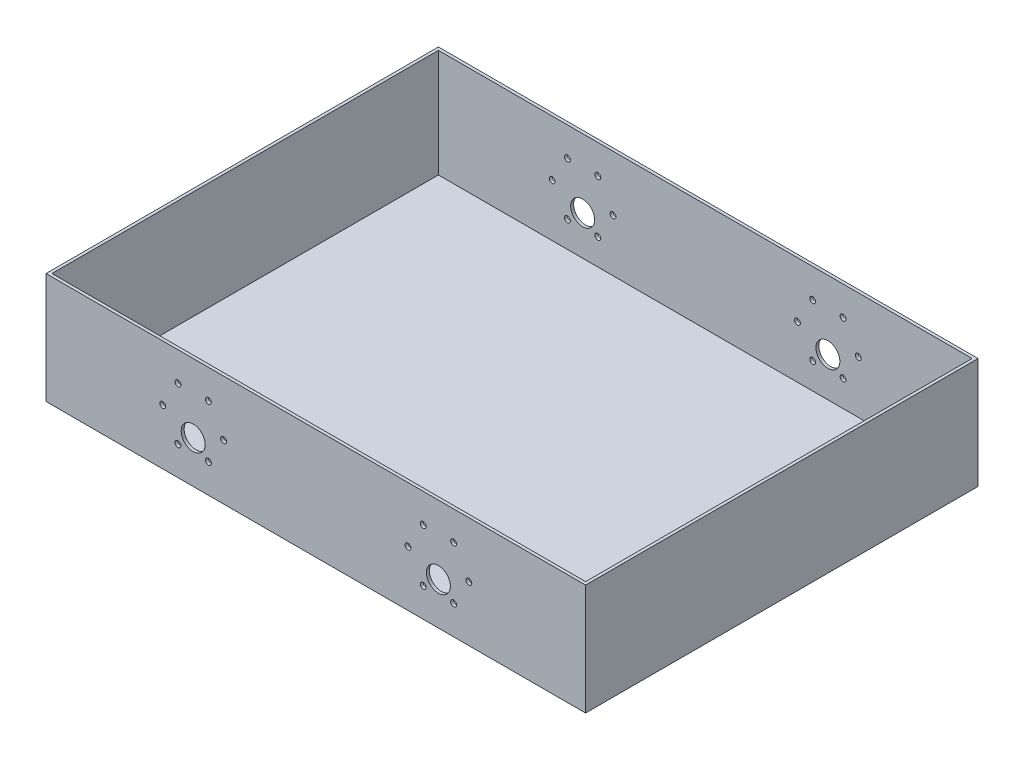
ISO-10303-21;
HEADER;
FILE_DESCRIPTION(('STEP AP214'),'2;1');
FILE_NAME('part.step','',(''),(''),'','','');
FILE_SCHEMA(('AUTOMOTIVE_DESIGN { 1 0 10303 214 1 1 1 1 }'));
ENDSEC;
DATA;
#1=APPLICATION_CONTEXT('core data for automotive mechanical design processes');
#2=APPLICATION_PROTOCOL_DEFINITION('international standard','automotive_design',2000,#1);
#3=PRODUCT_CONTEXT('',#1,'mechanical');
#4=PRODUCT('Part','Part','',(#3));
#5=PRODUCT_RELATED_PRODUCT_CATEGORY('part','',(#4));
#6=PRODUCT_DEFINITION_FORMATION('','',#4);
#7=PRODUCT_DEFINITION_CONTEXT('part definition',#1,'design');
#8=PRODUCT_DEFINITION('design','',#6,#7);
#9=PRODUCT_DEFINITION_SHAPE('','',#8);
#10=(LENGTH_UNIT() NAMED_UNIT(*) SI_UNIT(.MILLI.,.METRE.));
#11=(NAMED_UNIT(*) PLANE_ANGLE_UNIT() SI_UNIT($,.RADIAN.));
#12=(NAMED_UNIT(*) SI_UNIT($,.STERADIAN.) SOLID_ANGLE_UNIT());
#13=UNCERTAINTY_MEASURE_WITH_UNIT(LENGTH_MEASURE(1.E-05),#10,'distance_accuracy_value','');
#14=(GEOMETRIC_REPRESENTATION_CONTEXT(3) GLOBAL_UNCERTAINTY_ASSIGNED_CONTEXT((#13)) GLOBAL_UNIT_ASSIGNED_CONTEXT((#10,
#11,#12)) REPRESENTATION_CONTEXT('',''));
#15=CARTESIAN_POINT('',(0.,0.,0.));
#16=DIRECTION('',(0.,0.,1.));
#17=DIRECTION('',(1.,0.,0.));
#18=AXIS2_PLACEMENT_3D('',#15,#16,#17);
#19=CARTESIAN_POINT('',(-137.5,1.5,-100.));
#20=DIRECTION('',(0.,0.,1.));
#21=DIRECTION('',(1.,0.,0.));
#22=AXIS2_PLACEMENT_3D('',#19,#20,#21);
#23=PLANE('',#22);
#24=CARTESIAN_POINT('',(70.2499999999999,41.6733937586589,-100.));
#25=DIRECTION('',(0.,0.,-1.));
#26=DIRECTION('',(-1.,0.,0.));
#27=AXIS2_PLACEMENT_3D('',#24,#25,#26);
#28=CIRCLE('',#27,1.50000000000001);
#29=CARTESIAN_POINT('',(68.7499999999999,41.6733937586589,-100.));
#30=VERTEX_POINT('',#29);
#31=EDGE_CURVE('E376',#30,#30,#28,.T.);
#32=ORIENTED_EDGE('',*,*,#31,.F.);
#33=EDGE_LOOP('',(#32));
#34=FACE_BOUND('',#33,.T.);
#35=CARTESIAN_POINT('',(78.,28.2500000000001,-100.));
#36=DIRECTION('',(0.,0.,-1.));
#37=DIRECTION('',(-1.,0.,0.));
#38=AXIS2_PLACEMENT_3D('',#35,#36,#37);
#39=CIRCLE('',#38,1.50000000000001);
#40=CARTESIAN_POINT('',(76.5,28.2500000000001,-100.));
#41=VERTEX_POINT('',#40);
#42=EDGE_CURVE('E372',#41,#41,#39,.T.);
#43=ORIENTED_EDGE('',*,*,#42,.F.);
#44=EDGE_LOOP('',(#43));
#45=FACE_BOUND('',#44,.T.);
#46=CARTESIAN_POINT('',(54.7500000000001,14.8266062413412,-100.));
#47=DIRECTION('',(0.,0.,-1.));
#48=DIRECTION('',(-1.,0.,0.));
#49=AXIS2_PLACEMENT_3D('',#46,#47,#48);
#50=CIRCLE('',#49,1.5);
#51=CARTESIAN_POINT('',(53.2500000000001,14.8266062413412,-100.));
#52=VERTEX_POINT('',#51);
#53=EDGE_CURVE('E370',#52,#52,#50,.T.);
#54=ORIENTED_EDGE('',*,*,#53,.F.);
#55=EDGE_LOOP('',(#54));
#56=FACE_BOUND('',#55,.T.);
#57=CARTESIAN_POINT('',(70.2500000000001,14.8266062413412,-100.));
#58=DIRECTION('',(0.,0.,-1.));
#59=DIRECTION('',(-1.,0.,0.));
#60=AXIS2_PLACEMENT_3D('',#57,#58,#59);
#61=CIRCLE('',#60,1.5);
#62=CARTESIAN_POINT('',(68.7500000000001,14.8266062413412,-100.));
#63=VERTEX_POINT('',#62);
#64=EDGE_CURVE('E373',#63,#63,#61,.T.);
#65=ORIENTED_EDGE('',*,*,#64,.F.);
#66=EDGE_LOOP('',(#65));
#67=FACE_BOUND('',#66,.T.);
#68=CARTESIAN_POINT('',(-70.2500000000001,41.6733937586587,-100.));
#69=DIRECTION('',(0.,0.,-1.));
#70=DIRECTION('',(-1.,0.,0.));
#71=AXIS2_PLACEMENT_3D('',#68,#69,#70);
#72=CIRCLE('',#71,1.5);
#73=CARTESIAN_POINT('',(-71.7500000000001,41.6733937586587,-100.));
#74=VERTEX_POINT('',#73);
#75=EDGE_CURVE('E379',#74,#74,#72,.T.);
#76=ORIENTED_EDGE('',*,*,#75,.F.);
#77=EDGE_LOOP('',(#76));
#78=FACE_BOUND('',#77,.T.);
#79=CARTESIAN_POINT('',(-54.7500000000001,41.6733937586589,-100.));
#80=DIRECTION('',(0.,0.,-1.));
#81=DIRECTION('',(-1.,0.,0.));
#82=AXIS2_PLACEMENT_3D('',#79,#80,#81);
#83=CIRCLE('',#82,1.49999999999999);
#84=CARTESIAN_POINT('',(-56.2500000000001,41.6733937586589,-100.));
#85=VERTEX_POINT('',#84);
#86=EDGE_CURVE('E385',#85,#85,#83,.T.);
#87=ORIENTED_EDGE('',*,*,#86,.F.);
#88=EDGE_LOOP('',(#87));
#89=FACE_BOUND('',#88,.T.);
#90=CARTESIAN_POINT('',(-47.,28.2500000000001,-100.));
#91=DIRECTION('',(0.,0.,-1.));
#92=DIRECTION('',(-1.,0.,0.));
#93=AXIS2_PLACEMENT_3D('',#90,#91,#92);
#94=CIRCLE('',#93,1.49999999999999);
#95=CARTESIAN_POINT('',(-48.5,28.2500000000001,-100.));
#96=VERTEX_POINT('',#95);
#97=EDGE_CURVE('E388',#96,#96,#94,.T.);
#98=ORIENTED_EDGE('',*,*,#97,.F.);
#99=EDGE_LOOP('',(#98));
#100=FACE_BOUND('',#99,.T.);
#101=CARTESIAN_POINT('',(-54.7499999999999,14.8266062413412,-100.));
#102=DIRECTION('',(0.,0.,-1.));
#103=DIRECTION('',(-1.,0.,0.));
#104=AXIS2_PLACEMENT_3D('',#101,#102,#103);
#105=CIRCLE('',#104,1.50000000000001);
#106=CARTESIAN_POINT('',(-56.2499999999999,14.8266062413412,-100.));
#107=VERTEX_POINT('',#106);
#108=EDGE_CURVE('E391',#107,#107,#105,.T.);
#109=ORIENTED_EDGE('',*,*,#108,.F.);
#110=EDGE_LOOP('',(#109));
#111=FACE_BOUND('',#110,.T.);
#112=CARTESIAN_POINT('',(62.5,21.5,-100.));
#113=DIRECTION('',(0.,0.,-1.));
#114=DIRECTION('',(-1.,0.,0.));
#115=AXIS2_PLACEMENT_3D('',#112,#113,#114);
#116=CIRCLE('',#115,6.1);
#117=CARTESIAN_POINT('',(56.4,21.5,-100.));
#118=VERTEX_POINT('',#117);
#119=EDGE_CURVE('E491',#118,#118,#116,.T.);
#120=ORIENTED_EDGE('',*,*,#119,.F.);
#121=EDGE_LOOP('',(#120));
#122=FACE_BOUND('',#121,.T.);
#123=CARTESIAN_POINT('',(47.,28.25,-100.));
#124=DIRECTION('',(0.,0.,-1.));
#125=DIRECTION('',(-1.,0.,0.));
#126=AXIS2_PLACEMENT_3D('',#123,#124,#125);
#127=CIRCLE('',#126,1.5);
#128=CARTESIAN_POINT('',(45.5,28.25,-100.));
#129=VERTEX_POINT('',#128);
#130=EDGE_CURVE('E494',#129,#129,#127,.T.);
#131=ORIENTED_EDGE('',*,*,#130,.F.);
#132=EDGE_LOOP('',(#131));
#133=FACE_BOUND('',#132,.T.);
#134=CARTESIAN_POINT('',(-78.,28.25,-100.));
#135=DIRECTION('',(0.,0.,-1.));
#136=DIRECTION('',(-1.,0.,0.));
#137=AXIS2_PLACEMENT_3D('',#134,#135,#136);
#138=CIRCLE('',#137,1.5);
#139=CARTESIAN_POINT('',(-79.5,28.25,-100.));
#140=VERTEX_POINT('',#139);
#141=EDGE_CURVE('E499',#140,#140,#138,.T.);
#142=ORIENTED_EDGE('',*,*,#141,.F.);
#143=EDGE_LOOP('',(#142));
#144=FACE_BOUND('',#143,.T.);
#145=CARTESIAN_POINT('',(-70.2499999999999,14.8266062413412,-100.));
#146=DIRECTION('',(0.,0.,-1.));
#147=DIRECTION('',(-1.,0.,0.));
#148=AXIS2_PLACEMENT_3D('',#145,#146,#147);
#149=CIRCLE('',#148,1.5);
#150=CARTESIAN_POINT('',(-71.7499999999999,14.8266062413412,-100.));
#151=VERTEX_POINT('',#150);
#152=EDGE_CURVE('E394',#151,#151,#149,.T.);
#153=ORIENTED_EDGE('',*,*,#152,.F.);
#154=EDGE_LOOP('',(#153));
#155=FACE_BOUND('',#154,.T.);
#156=CARTESIAN_POINT('',(54.7499999999999,41.6733937586587,-100.));
#157=DIRECTION('',(0.,0.,-1.));
#158=DIRECTION('',(-1.,0.,0.));
#159=AXIS2_PLACEMENT_3D('',#156,#157,#158);
#160=CIRCLE('',#159,1.5);
#161=CARTESIAN_POINT('',(53.2499999999999,41.6733937586587,-100.));
#162=VERTEX_POINT('',#161);
#163=EDGE_CURVE('E182',#162,#162,#160,.T.);
#164=ORIENTED_EDGE('',*,*,#163,.F.);
#165=EDGE_LOOP('',(#164));
#166=FACE_BOUND('',#165,.T.);
#167=DIRECTION('',(-1.,0.,0.));
#168=VECTOR('',#167,1.);
#169=CARTESIAN_POINT('',(-137.5,0.,-100.));
#170=LINE('',#169,#168);
#171=CARTESIAN_POINT('',(137.5,0.,-100.));
#172=VERTEX_POINT('',#171);
#173=CARTESIAN_POINT('',(-137.5,0.,-100.));
#174=VERTEX_POINT('',#173);
#175=EDGE_CURVE('E167',#172,#174,#170,.T.);
#176=ORIENTED_EDGE('',*,*,#175,.T.);
#177=DIRECTION('',(0.,-1.,0.));
#178=VECTOR('',#177,1.);
#179=CARTESIAN_POINT('',(-137.5,1.5,-100.));
#180=LINE('',#179,#178);
#181=CARTESIAN_POINT('',(-137.5,56.5,-100.));
#182=VERTEX_POINT('',#181);
#183=EDGE_CURVE('E50',#182,#174,#180,.T.);
#184=ORIENTED_EDGE('',*,*,#183,.F.);
#185=DIRECTION('',(-1.,0.,0.));
#186=VECTOR('',#185,1.);
#187=CARTESIAN_POINT('',(137.5,56.5,-100.));
#188=LINE('',#187,#186);
#189=CARTESIAN_POINT('',(137.5,56.5,-100.));
#190=VERTEX_POINT('',#189);
#191=EDGE_CURVE('E155',#190,#182,#188,.T.);
#192=ORIENTED_EDGE('',*,*,#191,.F.);
#193=DIRECTION('',(0.,-1.,0.));
#194=VECTOR('',#193,1.);
#195=CARTESIAN_POINT('',(137.5,1.5,-100.));
#196=LINE('',#195,#194);
#197=EDGE_CURVE('E11',#190,#172,#196,.T.);
#198=ORIENTED_EDGE('',*,*,#197,.T.);
#199=EDGE_LOOP('',(#176,#184,#192,#198));
#200=FACE_BOUND('',#199,.T.);
#201=CARTESIAN_POINT('',(-62.5,21.5,-100.));
#202=DIRECTION('',(0.,0.,1.));
#203=DIRECTION('',(1.,0.,0.));
#204=AXIS2_PLACEMENT_3D('',#201,#202,#203);
#205=CIRCLE('',#204,6.1);
#206=CARTESIAN_POINT('',(-56.4,21.5,-100.));
#207=VERTEX_POINT('',#206);
#208=EDGE_CURVE('E489',#207,#207,#205,.T.);
#209=ORIENTED_EDGE('',*,*,#208,.T.);
#210=EDGE_LOOP('',(#209));
#211=FACE_BOUND('',#210,.T.);
#212=ADVANCED_FACE('F41',(#34,#45,#56,#67,#78,#89,#100,#111,#122,#133,#144,#155,#166,#200,#211),
#23,.F.);
#213=CARTESIAN_POINT('',(-137.5,1.5,100.));
#214=DIRECTION('',(0.,0.,-1.));
#215=DIRECTION('',(-1.,0.,0.));
#216=AXIS2_PLACEMENT_3D('',#213,#214,#215);
#217=PLANE('',#216);
#218=CARTESIAN_POINT('',(70.2499999999999,41.6733937586589,100.));
#219=DIRECTION('',(0.,0.,-1.));
#220=DIRECTION('',(-1.,0.,0.));
#221=AXIS2_PLACEMENT_3D('',#218,#219,#220);
#222=CIRCLE('',#221,1.50000000000001);
#223=CARTESIAN_POINT('',(68.7499999999999,41.6733937586589,100.));
#224=VERTEX_POINT('',#223);
#225=EDGE_CURVE('E142',#224,#224,#222,.T.);
#226=ORIENTED_EDGE('',*,*,#225,.T.);
#227=EDGE_LOOP('',(#226));
#228=FACE_BOUND('',#227,.T.);
#229=CARTESIAN_POINT('',(78.,28.2500000000001,100.));
#230=DIRECTION('',(0.,0.,-1.));
#231=DIRECTION('',(-1.,0.,0.));
#232=AXIS2_PLACEMENT_3D('',#229,#230,#231);
#233=CIRCLE('',#232,1.50000000000001);
#234=CARTESIAN_POINT('',(76.5,28.2500000000001,100.));
#235=VERTEX_POINT('',#234);
#236=EDGE_CURVE('E244',#235,#235,#233,.T.);
#237=ORIENTED_EDGE('',*,*,#236,.T.);
#238=EDGE_LOOP('',(#237));
#239=FACE_BOUND('',#238,.T.);
#240=CARTESIAN_POINT('',(54.7500000000001,14.8266062413412,100.));
#241=DIRECTION('',(0.,0.,-1.));
#242=DIRECTION('',(-1.,0.,0.));
#243=AXIS2_PLACEMENT_3D('',#240,#241,#242);
#244=CIRCLE('',#243,1.5);
#245=CARTESIAN_POINT('',(53.2500000000001,14.8266062413412,100.));
#246=VERTEX_POINT('',#245);
#247=EDGE_CURVE('E240',#246,#246,#244,.T.);
#248=ORIENTED_EDGE('',*,*,#247,.T.);
#249=EDGE_LOOP('',(#248));
#250=FACE_BOUND('',#249,.T.);
#251=CARTESIAN_POINT('',(70.2500000000001,14.8266062413412,100.));
#252=DIRECTION('',(0.,0.,-1.));
#253=DIRECTION('',(-1.,0.,0.));
#254=AXIS2_PLACEMENT_3D('',#251,#252,#253);
#255=CIRCLE('',#254,1.5);
#256=CARTESIAN_POINT('',(68.7500000000001,14.8266062413412,100.));
#257=VERTEX_POINT('',#256);
#258=EDGE_CURVE('E236',#257,#257,#255,.T.);
#259=ORIENTED_EDGE('',*,*,#258,.T.);
#260=EDGE_LOOP('',(#259));
#261=FACE_BOUND('',#260,.T.);
#262=CARTESIAN_POINT('',(-70.2500000000001,41.6733937586587,100.));
#263=DIRECTION('',(0.,0.,-1.));
#264=DIRECTION('',(-1.,0.,0.));
#265=AXIS2_PLACEMENT_3D('',#262,#263,#264);
#266=CIRCLE('',#265,1.5);
#267=CARTESIAN_POINT('',(-71.7500000000001,41.6733937586587,100.));
#268=VERTEX_POINT('',#267);
#269=EDGE_CURVE('E232',#268,#268,#266,.T.);
#270=ORIENTED_EDGE('',*,*,#269,.T.);
#271=EDGE_LOOP('',(#270));
#272=FACE_BOUND('',#271,.T.);
#273=CARTESIAN_POINT('',(-54.7500000000001,41.6733937586589,100.));
#274=DIRECTION('',(0.,0.,-1.));
#275=DIRECTION('',(-1.,0.,0.));
#276=AXIS2_PLACEMENT_3D('',#273,#274,#275);
#277=CIRCLE('',#276,1.49999999999999);
#278=CARTESIAN_POINT('',(-56.2500000000001,41.6733937586589,100.));
#279=VERTEX_POINT('',#278);
#280=EDGE_CURVE('E227',#279,#279,#277,.T.);
#281=ORIENTED_EDGE('',*,*,#280,.T.);
#282=EDGE_LOOP('',(#281));
#283=FACE_BOUND('',#282,.T.);
#284=CARTESIAN_POINT('',(-47.,28.2500000000001,100.));
#285=DIRECTION('',(0.,0.,-1.));
#286=DIRECTION('',(-1.,0.,0.));
#287=AXIS2_PLACEMENT_3D('',#284,#285,#286);
#288=CIRCLE('',#287,1.49999999999999);
#289=CARTESIAN_POINT('',(-48.5,28.2500000000001,100.));
#290=VERTEX_POINT('',#289);
#291=EDGE_CURVE('E222',#290,#290,#288,.T.);
#292=ORIENTED_EDGE('',*,*,#291,.T.);
#293=EDGE_LOOP('',(#292));
#294=FACE_BOUND('',#293,.T.);
#295=CARTESIAN_POINT('',(-54.7499999999999,14.8266062413412,100.));
#296=DIRECTION('',(0.,0.,-1.));
#297=DIRECTION('',(-1.,0.,0.));
#298=AXIS2_PLACEMENT_3D('',#295,#296,#297);
#299=CIRCLE('',#298,1.50000000000001);
#300=CARTESIAN_POINT('',(-56.2499999999999,14.8266062413412,100.));
#301=VERTEX_POINT('',#300);
#302=EDGE_CURVE('E217',#301,#301,#299,.T.);
#303=ORIENTED_EDGE('',*,*,#302,.T.);
#304=EDGE_LOOP('',(#303));
#305=FACE_BOUND('',#304,.T.);
#306=CARTESIAN_POINT('',(62.5,21.5,100.));
#307=DIRECTION('',(0.,0.,-1.));
#308=DIRECTION('',(-1.,0.,0.));
#309=AXIS2_PLACEMENT_3D('',#306,#307,#308);
#310=CIRCLE('',#309,6.1);
#311=CARTESIAN_POINT('',(56.4,21.5,100.));
#312=VERTEX_POINT('',#311);
#313=EDGE_CURVE('E207',#312,#312,#310,.T.);
#314=ORIENTED_EDGE('',*,*,#313,.T.);
#315=EDGE_LOOP('',(#314));
#316=FACE_BOUND('',#315,.T.);
#317=CARTESIAN_POINT('',(47.,28.25,100.));
#318=DIRECTION('',(0.,0.,-1.));
#319=DIRECTION('',(-1.,0.,0.));
#320=AXIS2_PLACEMENT_3D('',#317,#318,#319);
#321=CIRCLE('',#320,1.5);
#322=CARTESIAN_POINT('',(45.5,28.25,100.));
#323=VERTEX_POINT('',#322);
#324=EDGE_CURVE('E202',#323,#323,#321,.T.);
#325=ORIENTED_EDGE('',*,*,#324,.T.);
#326=EDGE_LOOP('',(#325));
#327=FACE_BOUND('',#326,.T.);
#328=CARTESIAN_POINT('',(-78.,28.25,100.));
#329=DIRECTION('',(0.,0.,-1.));
#330=DIRECTION('',(-1.,0.,0.));
#331=AXIS2_PLACEMENT_3D('',#328,#329,#330);
#332=CIRCLE('',#331,1.5);
#333=CARTESIAN_POINT('',(-79.5,28.25,100.));
#334=VERTEX_POINT('',#333);
#335=EDGE_CURVE('E197',#334,#334,#332,.T.);
#336=ORIENTED_EDGE('',*,*,#335,.T.);
#337=EDGE_LOOP('',(#336));
#338=FACE_BOUND('',#337,.T.);
#339=CARTESIAN_POINT('',(-70.2499999999999,14.8266062413412,100.));
#340=DIRECTION('',(0.,0.,-1.));
#341=DIRECTION('',(-1.,0.,0.));
#342=AXIS2_PLACEMENT_3D('',#339,#340,#341);
#343=CIRCLE('',#342,1.5);
#344=CARTESIAN_POINT('',(-71.7499999999999,14.8266062413412,100.));
#345=VERTEX_POINT('',#344);
#346=EDGE_CURVE('E192',#345,#345,#343,.T.);
#347=ORIENTED_EDGE('',*,*,#346,.T.);
#348=EDGE_LOOP('',(#347));
#349=FACE_BOUND('',#348,.T.);
#350=CARTESIAN_POINT('',(54.7499999999999,41.6733937586587,100.));
#351=DIRECTION('',(0.,0.,-1.));
#352=DIRECTION('',(-1.,0.,0.));
#353=AXIS2_PLACEMENT_3D('',#350,#351,#352);
#354=CIRCLE('',#353,1.5);
#355=CARTESIAN_POINT('',(53.2499999999999,41.6733937586587,100.));
#356=VERTEX_POINT('',#355);
#357=EDGE_CURVE('E187',#356,#356,#354,.T.);
#358=ORIENTED_EDGE('',*,*,#357,.T.);
#359=EDGE_LOOP('',(#358));
#360=FACE_BOUND('',#359,.T.);
#361=DIRECTION('',(1.,0.,0.));
#362=VECTOR('',#361,1.);
#363=CARTESIAN_POINT('',(-137.5,0.,100.));
#364=LINE('',#363,#362);
#365=CARTESIAN_POINT('',(-137.5,0.,100.));
#366=VERTEX_POINT('',#365);
#367=CARTESIAN_POINT('',(137.5,0.,100.));
#368=VERTEX_POINT('',#367);
#369=EDGE_CURVE('E66',#366,#368,#364,.T.);
#370=ORIENTED_EDGE('',*,*,#369,.T.);
#371=DIRECTION('',(0.,-1.,0.));
#372=VECTOR('',#371,1.);
#373=CARTESIAN_POINT('',(137.5,1.5,100.));
#374=LINE('',#373,#372);
#375=CARTESIAN_POINT('',(137.5,56.5,100.));
#376=VERTEX_POINT('',#375);
#377=EDGE_CURVE('E172',#376,#368,#374,.T.);
#378=ORIENTED_EDGE('',*,*,#377,.F.);
#379=DIRECTION('',(1.,0.,0.));
#380=VECTOR('',#379,1.);
#381=CARTESIAN_POINT('',(-137.5,56.5,100.));
#382=LINE('',#381,#380);
#383=CARTESIAN_POINT('',(-137.5,56.5,100.));
#384=VERTEX_POINT('',#383);
#385=EDGE_CURVE('E161',#384,#376,#382,.T.);
#386=ORIENTED_EDGE('',*,*,#385,.F.);
#387=DIRECTION('',(0.,-1.,0.));
#388=VECTOR('',#387,1.);
#389=CARTESIAN_POINT('',(-137.5,1.5,100.));
#390=LINE('',#389,#388);
#391=EDGE_CURVE('E174',#384,#366,#390,.T.);
#392=ORIENTED_EDGE('',*,*,#391,.T.);
#393=EDGE_LOOP('',(#370,#378,#386,#392));
#394=FACE_BOUND('',#393,.T.);
#395=CARTESIAN_POINT('',(-62.5,21.5,100.));
#396=DIRECTION('',(0.,0.,-1.));
#397=DIRECTION('',(-1.,0.,0.));
#398=AXIS2_PLACEMENT_3D('',#395,#396,#397);
#399=CIRCLE('',#398,6.1);
#400=CARTESIAN_POINT('',(-68.6000000000001,21.5,100.));
#401=VERTEX_POINT('',#400);
#402=EDGE_CURVE('E212',#401,#401,#399,.F.);
#403=ORIENTED_EDGE('',*,*,#402,.F.);
#404=EDGE_LOOP('',(#403));
#405=FACE_BOUND('',#404,.T.);
#406=ADVANCED_FACE('F261',(#228,#239,#250,#261,#272,#283,#294,#305,#316,#327,#338,#349,#360,
#394,#405),#217,.F.);
#407=CARTESIAN_POINT('',(-136.,56.5,-98.5));
#408=DIRECTION('',(0.,0.,1.));
#409=DIRECTION('',(1.,0.,0.));
#410=AXIS2_PLACEMENT_3D('',#407,#408,#409);
#411=PLANE('',#410);
#412=CARTESIAN_POINT('',(70.2499999999999,41.6733937586589,-98.5));
#413=DIRECTION('',(0.,0.,1.));
#414=DIRECTION('',(1.,0.,0.));
#415=AXIS2_PLACEMENT_3D('',#412,#413,#414);
#416=CIRCLE('',#415,1.50000000000001);
#417=CARTESIAN_POINT('',(71.7499999999999,41.6733937586589,-98.5));
#418=VERTEX_POINT('',#417);
#419=EDGE_CURVE('E256',#418,#418,#416,.T.);
#420=ORIENTED_EDGE('',*,*,#419,.F.);
#421=EDGE_LOOP('',(#420));
#422=FACE_BOUND('',#421,.T.);
#423=CARTESIAN_POINT('',(78.,28.2500000000001,-98.5));
#424=DIRECTION('',(0.,0.,1.));
#425=DIRECTION('',(1.,0.,0.));
#426=AXIS2_PLACEMENT_3D('',#423,#424,#425);
#427=CIRCLE('',#426,1.50000000000001);
#428=CARTESIAN_POINT('',(79.5,28.2500000000001,-98.5));
#429=VERTEX_POINT('',#428);
#430=EDGE_CURVE('E239',#429,#429,#427,.T.);
#431=ORIENTED_EDGE('',*,*,#430,.F.);
#432=EDGE_LOOP('',(#431));
#433=FACE_BOUND('',#432,.T.);
#434=CARTESIAN_POINT('',(54.7500000000001,14.8266062413412,-98.5));
#435=DIRECTION('',(0.,0.,1.));
#436=DIRECTION('',(1.,0.,0.));
#437=AXIS2_PLACEMENT_3D('',#434,#435,#436);
#438=CIRCLE('',#437,1.5);
#439=CARTESIAN_POINT('',(56.2500000000001,14.8266062413412,-98.5));
#440=VERTEX_POINT('',#439);
#441=EDGE_CURVE('E235',#440,#440,#438,.T.);
#442=ORIENTED_EDGE('',*,*,#441,.F.);
#443=EDGE_LOOP('',(#442));
#444=FACE_BOUND('',#443,.T.);
#445=CARTESIAN_POINT('',(70.2500000000001,14.8266062413412,-98.5));
#446=DIRECTION('',(0.,0.,1.));
#447=DIRECTION('',(1.,0.,0.));
#448=AXIS2_PLACEMENT_3D('',#445,#446,#447);
#449=CIRCLE('',#448,1.5);
#450=CARTESIAN_POINT('',(71.7500000000001,14.8266062413412,-98.5));
#451=VERTEX_POINT('',#450);
#452=EDGE_CURVE('E231',#451,#451,#449,.T.);
#453=ORIENTED_EDGE('',*,*,#452,.F.);
#454=EDGE_LOOP('',(#453));
#455=FACE_BOUND('',#454,.T.);
#456=CARTESIAN_POINT('',(-70.2500000000001,41.6733937586587,-98.5));
#457=DIRECTION('',(0.,0.,1.));
#458=DIRECTION('',(1.,0.,0.));
#459=AXIS2_PLACEMENT_3D('',#456,#457,#458);
#460=CIRCLE('',#459,1.5);
#461=CARTESIAN_POINT('',(-68.7500000000001,41.6733937586587,-98.5));
#462=VERTEX_POINT('',#461);
#463=EDGE_CURVE('E226',#462,#462,#460,.T.);
#464=ORIENTED_EDGE('',*,*,#463,.F.);
#465=EDGE_LOOP('',(#464));
#466=FACE_BOUND('',#465,.T.);
#467=CARTESIAN_POINT('',(-54.7500000000001,41.6733937586589,-98.5));
#468=DIRECTION('',(0.,0.,1.));
#469=DIRECTION('',(1.,0.,0.));
#470=AXIS2_PLACEMENT_3D('',#467,#468,#469);
#471=CIRCLE('',#470,1.49999999999999);
#472=CARTESIAN_POINT('',(-53.2500000000001,41.6733937586589,-98.5));
#473=VERTEX_POINT('',#472);
#474=EDGE_CURVE('E221',#473,#473,#471,.T.);
#475=ORIENTED_EDGE('',*,*,#474,.F.);
#476=EDGE_LOOP('',(#475));
#477=FACE_BOUND('',#476,.T.);
#478=CARTESIAN_POINT('',(-47.,28.2500000000001,-98.5));
#479=DIRECTION('',(0.,0.,1.));
#480=DIRECTION('',(1.,0.,0.));
#481=AXIS2_PLACEMENT_3D('',#478,#479,#480);
#482=CIRCLE('',#481,1.49999999999999);
#483=CARTESIAN_POINT('',(-45.5,28.2500000000001,-98.5));
#484=VERTEX_POINT('',#483);
#485=EDGE_CURVE('E216',#484,#484,#482,.T.);
#486=ORIENTED_EDGE('',*,*,#485,.F.);
#487=EDGE_LOOP('',(#486));
#488=FACE_BOUND('',#487,.T.);
#489=CARTESIAN_POINT('',(-54.7499999999999,14.8266062413412,-98.5));
#490=DIRECTION('',(0.,0.,1.));
#491=DIRECTION('',(1.,0.,0.));
#492=AXIS2_PLACEMENT_3D('',#489,#490,#491);
#493=CIRCLE('',#492,1.50000000000001);
#494=CARTESIAN_POINT('',(-53.2499999999999,14.8266062413412,-98.5));
#495=VERTEX_POINT('',#494);
#496=EDGE_CURVE('E211',#495,#495,#493,.T.);
#497=ORIENTED_EDGE('',*,*,#496,.F.);
#498=EDGE_LOOP('',(#497));
#499=FACE_BOUND('',#498,.T.);
#500=DIRECTION('',(-1.,0.,0.));
#501=VECTOR('',#500,1.);
#502=CARTESIAN_POINT('',(-136.,1.5,-98.5));
#503=LINE('',#502,#501);
#504=CARTESIAN_POINT('',(136.,1.5,-98.5));
#505=VERTEX_POINT('',#504);
#506=CARTESIAN_POINT('',(-136.,1.5,-98.5));
#507=VERTEX_POINT('',#506);
#508=EDGE_CURVE('E126',#505,#507,#503,.T.);
#509=ORIENTED_EDGE('',*,*,#508,.F.);
#510=DIRECTION('',(0.,-1.,0.));
#511=VECTOR('',#510,1.);
#512=CARTESIAN_POINT('',(136.,56.5,-98.5));
#513=LINE('',#512,#511);
#514=CARTESIAN_POINT('',(136.,56.5,-98.5));
#515=VERTEX_POINT('',#514);
#516=EDGE_CURVE('E113',#515,#505,#513,.T.);
#517=ORIENTED_EDGE('',*,*,#516,.F.);
#518=DIRECTION('',(-1.,0.,0.));
#519=VECTOR('',#518,1.);
#520=CARTESIAN_POINT('',(-136.,56.5,-98.5));
#521=LINE('',#520,#519);
#522=CARTESIAN_POINT('',(-136.,56.5,-98.5));
#523=VERTEX_POINT('',#522);
#524=EDGE_CURVE('E118',#515,#523,#521,.T.);
#525=ORIENTED_EDGE('',*,*,#524,.T.);
#526=DIRECTION('',(0.,-1.,0.));
#527=VECTOR('',#526,1.);
#528=CARTESIAN_POINT('',(-136.,56.5,-98.5));
#529=LINE('',#528,#527);
#530=EDGE_CURVE('E128',#523,#507,#529,.T.);
#531=ORIENTED_EDGE('',*,*,#530,.T.);
#532=EDGE_LOOP('',(#509,#517,#525,#531));
#533=FACE_BOUND('',#532,.T.);
#534=CARTESIAN_POINT('',(54.7499999999999,41.6733937586587,-98.5));
#535=DIRECTION('',(0.,0.,1.));
#536=DIRECTION('',(1.,0.,0.));
#537=AXIS2_PLACEMENT_3D('',#534,#535,#536);
#538=CIRCLE('',#537,1.5);
#539=CARTESIAN_POINT('',(56.2499999999999,41.6733937586587,-98.5));
#540=VERTEX_POINT('',#539);
#541=EDGE_CURVE('E181',#540,#540,#538,.T.);
#542=ORIENTED_EDGE('',*,*,#541,.F.);
#543=EDGE_LOOP('',(#542));
#544=FACE_BOUND('',#543,.T.);
#545=CARTESIAN_POINT('',(-70.2499999999999,14.8266062413412,-98.5));
#546=DIRECTION('',(0.,0.,1.));
#547=DIRECTION('',(1.,0.,0.));
#548=AXIS2_PLACEMENT_3D('',#545,#546,#547);
#549=CIRCLE('',#548,1.5);
#550=CARTESIAN_POINT('',(-68.7499999999999,14.8266062413412,-98.5));
#551=VERTEX_POINT('',#550);
#552=EDGE_CURVE('E186',#551,#551,#549,.T.);
#553=ORIENTED_EDGE('',*,*,#552,.F.);
#554=EDGE_LOOP('',(#553));
#555=FACE_BOUND('',#554,.T.);
#556=CARTESIAN_POINT('',(-78.,28.25,-98.5));
#557=DIRECTION('',(0.,0.,1.));
#558=DIRECTION('',(1.,0.,0.));
#559=AXIS2_PLACEMENT_3D('',#556,#557,#558);
#560=CIRCLE('',#559,1.5);
#561=CARTESIAN_POINT('',(-76.5,28.25,-98.5));
#562=VERTEX_POINT('',#561);
#563=EDGE_CURVE('E191',#562,#562,#560,.T.);
#564=ORIENTED_EDGE('',*,*,#563,.F.);
#565=EDGE_LOOP('',(#564));
#566=FACE_BOUND('',#565,.T.);
#567=CARTESIAN_POINT('',(47.,28.25,-98.5));
#568=DIRECTION('',(0.,0.,1.));
#569=DIRECTION('',(1.,0.,0.));
#570=AXIS2_PLACEMENT_3D('',#567,#568,#569);
#571=CIRCLE('',#570,1.5);
#572=CARTESIAN_POINT('',(48.5,28.25,-98.5));
#573=VERTEX_POINT('',#572);
#574=EDGE_CURVE('E196',#573,#573,#571,.T.);
#575=ORIENTED_EDGE('',*,*,#574,.F.);
#576=EDGE_LOOP('',(#575));
#577=FACE_BOUND('',#576,.T.);
#578=CARTESIAN_POINT('',(62.5,21.5,-98.5));
#579=DIRECTION('',(0.,0.,1.));
#580=DIRECTION('',(1.,0.,0.));
#581=AXIS2_PLACEMENT_3D('',#578,#579,#580);
#582=CIRCLE('',#581,6.1);
#583=CARTESIAN_POINT('',(68.6000000000001,21.5,-98.5));
#584=VERTEX_POINT('',#583);
#585=EDGE_CURVE('E201',#584,#584,#582,.T.);
#586=ORIENTED_EDGE('',*,*,#585,.F.);
#587=EDGE_LOOP('',(#586));
#588=FACE_BOUND('',#587,.T.);
#589=CARTESIAN_POINT('',(-62.5,21.5,-98.5));
#590=DIRECTION('',(0.,0.,1.));
#591=DIRECTION('',(1.,0.,0.));
#592=AXIS2_PLACEMENT_3D('',#589,#590,#591);
#593=CIRCLE('',#592,6.1);
#594=CARTESIAN_POINT('',(-56.4,21.5,-98.5));
#595=VERTEX_POINT('',#594);
#596=EDGE_CURVE('E206',#595,#595,#593,.F.);
#597=ORIENTED_EDGE('',*,*,#596,.T.);
#598=EDGE_LOOP('',(#597));
#599=FACE_BOUND('',#598,.T.);
#600=ADVANCED_FACE('F122',(#422,#433,#444,#455,#466,#477,#488,#499,#533,#544,#555,#566,#577,
#588,#599),#411,.T.);
#601=CARTESIAN_POINT('',(-136.,56.5,98.5));
#602=DIRECTION('',(0.,0.,-1.));
#603=DIRECTION('',(-1.,0.,0.));
#604=AXIS2_PLACEMENT_3D('',#601,#602,#603);
#605=PLANE('',#604);
#606=CARTESIAN_POINT('',(70.2499999999999,41.6733937586589,98.5));
#607=DIRECTION('',(0.,0.,-1.));
#608=DIRECTION('',(-1.,0.,0.));
#609=AXIS2_PLACEMENT_3D('',#606,#607,#608);
#610=CIRCLE('',#609,1.50000000000001);
#611=CARTESIAN_POINT('',(68.7499999999999,41.6733937586589,98.5));
#612=VERTEX_POINT('',#611);
#613=EDGE_CURVE('E45',#612,#612,#610,.T.);
#614=ORIENTED_EDGE('',*,*,#613,.F.);
#615=EDGE_LOOP('',(#614));
#616=FACE_BOUND('',#615,.T.);
#617=CARTESIAN_POINT('',(78.,28.2500000000001,98.5));
#618=DIRECTION('',(0.,0.,-1.));
#619=DIRECTION('',(-1.,0.,0.));
#620=AXIS2_PLACEMENT_3D('',#617,#618,#619);
#621=CIRCLE('',#620,1.50000000000001);
#622=CARTESIAN_POINT('',(76.5,28.2500000000001,98.5));
#623=VERTEX_POINT('',#622);
#624=EDGE_CURVE('E237',#623,#623,#621,.T.);
#625=ORIENTED_EDGE('',*,*,#624,.F.);
#626=EDGE_LOOP('',(#625));
#627=FACE_BOUND('',#626,.T.);
#628=CARTESIAN_POINT('',(54.7500000000001,14.8266062413412,98.5));
#629=DIRECTION('',(0.,0.,-1.));
#630=DIRECTION('',(-1.,0.,0.));
#631=AXIS2_PLACEMENT_3D('',#628,#629,#630);
#632=CIRCLE('',#631,1.5);
#633=CARTESIAN_POINT('',(53.2500000000001,14.8266062413412,98.5));
#634=VERTEX_POINT('',#633);
#635=EDGE_CURVE('E233',#634,#634,#632,.T.);
#636=ORIENTED_EDGE('',*,*,#635,.F.);
#637=EDGE_LOOP('',(#636));
#638=FACE_BOUND('',#637,.T.);
#639=CARTESIAN_POINT('',(70.2500000000001,14.8266062413412,98.5));
#640=DIRECTION('',(0.,0.,-1.));
#641=DIRECTION('',(-1.,0.,0.));
#642=AXIS2_PLACEMENT_3D('',#639,#640,#641);
#643=CIRCLE('',#642,1.5);
#644=CARTESIAN_POINT('',(68.7500000000001,14.8266062413412,98.5));
#645=VERTEX_POINT('',#644);
#646=EDGE_CURVE('E228',#645,#645,#643,.T.);
#647=ORIENTED_EDGE('',*,*,#646,.F.);
#648=EDGE_LOOP('',(#647));
#649=FACE_BOUND('',#648,.T.);
#650=CARTESIAN_POINT('',(-70.2500000000001,41.6733937586587,98.5));
#651=DIRECTION('',(0.,0.,-1.));
#652=DIRECTION('',(-1.,0.,0.));
#653=AXIS2_PLACEMENT_3D('',#650,#651,#652);
#654=CIRCLE('',#653,1.5);
#655=CARTESIAN_POINT('',(-71.7500000000001,41.6733937586587,98.5));
#656=VERTEX_POINT('',#655);
#657=EDGE_CURVE('E223',#656,#656,#654,.T.);
#658=ORIENTED_EDGE('',*,*,#657,.F.);
#659=EDGE_LOOP('',(#658));
#660=FACE_BOUND('',#659,.T.);
#661=CARTESIAN_POINT('',(-54.7500000000001,41.6733937586589,98.5));
#662=DIRECTION('',(0.,0.,-1.));
#663=DIRECTION('',(-1.,0.,0.));
#664=AXIS2_PLACEMENT_3D('',#661,#662,#663);
#665=CIRCLE('',#664,1.49999999999999);
#666=CARTESIAN_POINT('',(-56.2500000000001,41.6733937586589,98.5));
#667=VERTEX_POINT('',#666);
#668=EDGE_CURVE('E218',#667,#667,#665,.T.);
#669=ORIENTED_EDGE('',*,*,#668,.F.);
#670=EDGE_LOOP('',(#669));
#671=FACE_BOUND('',#670,.T.);
#672=CARTESIAN_POINT('',(-47.,28.2500000000001,98.5));
#673=DIRECTION('',(0.,0.,-1.));
#674=DIRECTION('',(-1.,0.,0.));
#675=AXIS2_PLACEMENT_3D('',#672,#673,#674);
#676=CIRCLE('',#675,1.49999999999999);
#677=CARTESIAN_POINT('',(-48.5,28.2500000000001,98.5));
#678=VERTEX_POINT('',#677);
#679=EDGE_CURVE('E213',#678,#678,#676,.T.);
#680=ORIENTED_EDGE('',*,*,#679,.F.);
#681=EDGE_LOOP('',(#680));
#682=FACE_BOUND('',#681,.T.);
#683=CARTESIAN_POINT('',(-54.7499999999999,14.8266062413412,98.5));
#684=DIRECTION('',(0.,0.,-1.));
#685=DIRECTION('',(-1.,0.,0.));
#686=AXIS2_PLACEMENT_3D('',#683,#684,#685);
#687=CIRCLE('',#686,1.50000000000001);
#688=CARTESIAN_POINT('',(-56.2499999999999,14.8266062413412,98.5));
#689=VERTEX_POINT('',#688);
#690=EDGE_CURVE('E208',#689,#689,#687,.T.);
#691=ORIENTED_EDGE('',*,*,#690,.F.);
#692=EDGE_LOOP('',(#691));
#693=FACE_BOUND('',#692,.T.);
#694=DIRECTION('',(1.,0.,0.));
#695=VECTOR('',#694,1.);
#696=CARTESIAN_POINT('',(-136.,1.5,98.5));
#697=LINE('',#696,#695);
#698=CARTESIAN_POINT('',(-136.,1.5,98.5));
#699=VERTEX_POINT('',#698);
#700=CARTESIAN_POINT('',(136.,1.5,98.5));
#701=VERTEX_POINT('',#700);
#702=EDGE_CURVE('E119',#699,#701,#697,.T.);
#703=ORIENTED_EDGE('',*,*,#702,.F.);
#704=DIRECTION('',(0.,-1.,0.));
#705=VECTOR('',#704,1.);
#706=CARTESIAN_POINT('',(-136.,56.5,98.5));
#707=LINE('',#706,#705);
#708=CARTESIAN_POINT('',(-136.,56.5,98.5));
#709=VERTEX_POINT('',#708);
#710=EDGE_CURVE('E150',#709,#699,#707,.T.);
#711=ORIENTED_EDGE('',*,*,#710,.F.);
#712=DIRECTION('',(1.,0.,0.));
#713=VECTOR('',#712,1.);
#714=CARTESIAN_POINT('',(-136.,56.5,98.5));
#715=LINE('',#714,#713);
#716=CARTESIAN_POINT('',(136.,56.5,98.5));
#717=VERTEX_POINT('',#716);
#718=EDGE_CURVE('E135',#709,#717,#715,.T.);
#719=ORIENTED_EDGE('',*,*,#718,.T.);
#720=DIRECTION('',(0.,-1.,0.));
#721=VECTOR('',#720,1.);
#722=CARTESIAN_POINT('',(136.,56.5,98.5));
#723=LINE('',#722,#721);
#724=EDGE_CURVE('E58',#717,#701,#723,.T.);
#725=ORIENTED_EDGE('',*,*,#724,.T.);
#726=EDGE_LOOP('',(#703,#711,#719,#725));
#727=FACE_BOUND('',#726,.T.);
#728=CARTESIAN_POINT('',(54.7499999999999,41.6733937586587,98.5));
#729=DIRECTION('',(0.,0.,-1.));
#730=DIRECTION('',(-1.,0.,0.));
#731=AXIS2_PLACEMENT_3D('',#728,#729,#730);
#732=CIRCLE('',#731,1.5);
#733=CARTESIAN_POINT('',(53.2499999999999,41.6733937586587,98.5));
#734=VERTEX_POINT('',#733);
#735=EDGE_CURVE('E178',#734,#734,#732,.T.);
#736=ORIENTED_EDGE('',*,*,#735,.F.);
#737=EDGE_LOOP('',(#736));
#738=FACE_BOUND('',#737,.T.);
#739=CARTESIAN_POINT('',(-70.2499999999999,14.8266062413412,98.5));
#740=DIRECTION('',(0.,0.,-1.));
#741=DIRECTION('',(-1.,0.,0.));
#742=AXIS2_PLACEMENT_3D('',#739,#740,#741);
#743=CIRCLE('',#742,1.5);
#744=CARTESIAN_POINT('',(-71.7499999999999,14.8266062413412,98.5));
#745=VERTEX_POINT('',#744);
#746=EDGE_CURVE('E183',#745,#745,#743,.T.);
#747=ORIENTED_EDGE('',*,*,#746,.F.);
#748=EDGE_LOOP('',(#747));
#749=FACE_BOUND('',#748,.T.);
#750=CARTESIAN_POINT('',(-78.,28.25,98.5));
#751=DIRECTION('',(0.,0.,-1.));
#752=DIRECTION('',(-1.,0.,0.));
#753=AXIS2_PLACEMENT_3D('',#750,#751,#752);
#754=CIRCLE('',#753,1.5);
#755=CARTESIAN_POINT('',(-79.5,28.25,98.5));
#756=VERTEX_POINT('',#755);
#757=EDGE_CURVE('E188',#756,#756,#754,.T.);
#758=ORIENTED_EDGE('',*,*,#757,.F.);
#759=EDGE_LOOP('',(#758));
#760=FACE_BOUND('',#759,.T.);
#761=CARTESIAN_POINT('',(47.,28.25,98.5));
#762=DIRECTION('',(0.,0.,-1.));
#763=DIRECTION('',(-1.,0.,0.));
#764=AXIS2_PLACEMENT_3D('',#761,#762,#763);
#765=CIRCLE('',#764,1.5);
#766=CARTESIAN_POINT('',(45.5,28.25,98.5));
#767=VERTEX_POINT('',#766);
#768=EDGE_CURVE('E193',#767,#767,#765,.T.);
#769=ORIENTED_EDGE('',*,*,#768,.F.);
#770=EDGE_LOOP('',(#769));
#771=FACE_BOUND('',#770,.T.);
#772=CARTESIAN_POINT('',(62.5,21.5,98.5));
#773=DIRECTION('',(0.,0.,-1.));
#774=DIRECTION('',(-1.,0.,0.));
#775=AXIS2_PLACEMENT_3D('',#772,#773,#774);
#776=CIRCLE('',#775,6.1);
#777=CARTESIAN_POINT('',(56.4,21.5,98.5));
#778=VERTEX_POINT('',#777);
#779=EDGE_CURVE('E198',#778,#778,#776,.T.);
#780=ORIENTED_EDGE('',*,*,#779,.F.);
#781=EDGE_LOOP('',(#780));
#782=FACE_BOUND('',#781,.T.);
#783=CARTESIAN_POINT('',(-62.5,21.5,98.5));
#784=DIRECTION('',(0.,0.,-1.));
#785=DIRECTION('',(-1.,0.,0.));
#786=AXIS2_PLACEMENT_3D('',#783,#784,#785);
#787=CIRCLE('',#786,6.1);
#788=CARTESIAN_POINT('',(-68.6000000000001,21.5,98.5));
#789=VERTEX_POINT('',#788);
#790=EDGE_CURVE('E203',#789,#789,#787,.F.);
#791=ORIENTED_EDGE('',*,*,#790,.T.);
#792=EDGE_LOOP('',(#791));
#793=FACE_BOUND('',#792,.T.);
#794=ADVANCED_FACE('F315',(#616,#627,#638,#649,#660,#671,#682,#693,#727,#738,#749,#760,#771,
#782,#793),#605,.T.);
#795=CARTESIAN_POINT('',(137.5,1.5,100.));
#796=DIRECTION('',(-1.,0.,0.));
#797=DIRECTION('',(0.,0.,1.));
#798=AXIS2_PLACEMENT_3D('',#795,#796,#797);
#799=PLANE('',#798);
#800=DIRECTION('',(0.,0.,-1.));
#801=VECTOR('',#800,1.);
#802=CARTESIAN_POINT('',(137.5,0.,100.));
#803=LINE('',#802,#801);
#804=EDGE_CURVE('E164',#368,#172,#803,.T.);
#805=ORIENTED_EDGE('',*,*,#804,.T.);
#806=ORIENTED_EDGE('',*,*,#197,.F.);
#807=DIRECTION('',(0.,0.,-1.));
#808=VECTOR('',#807,1.);
#809=CARTESIAN_POINT('',(137.5,56.5,100.));
#810=LINE('',#809,#808);
#811=EDGE_CURVE('E127',#376,#190,#810,.T.);
#812=ORIENTED_EDGE('',*,*,#811,.F.);
#813=ORIENTED_EDGE('',*,*,#377,.T.);
#814=EDGE_LOOP('',(#805,#806,#812,#813));
#815=FACE_BOUND('',#814,.T.);
#816=ADVANCED_FACE('F43',(#815),#799,.F.);
#817=CARTESIAN_POINT('',(-137.5,1.5,100.));
#818=DIRECTION('',(1.,0.,0.));
#819=DIRECTION('',(0.,0.,-1.));
#820=AXIS2_PLACEMENT_3D('',#817,#818,#819);
#821=PLANE('',#820);
#822=DIRECTION('',(0.,0.,1.));
#823=VECTOR('',#822,1.);
#824=CARTESIAN_POINT('',(-137.5,0.,100.));
#825=LINE('',#824,#823);
#826=EDGE_CURVE('E169',#174,#366,#825,.T.);
#827=ORIENTED_EDGE('',*,*,#826,.T.);
#828=ORIENTED_EDGE('',*,*,#391,.F.);
#829=DIRECTION('',(0.,0.,1.));
#830=VECTOR('',#829,1.);
#831=CARTESIAN_POINT('',(-137.5,56.5,-100.));
#832=LINE('',#831,#830);
#833=EDGE_CURVE('E158',#182,#384,#832,.T.);
#834=ORIENTED_EDGE('',*,*,#833,.F.);
#835=ORIENTED_EDGE('',*,*,#183,.T.);
#836=EDGE_LOOP('',(#827,#828,#834,#835));
#837=FACE_BOUND('',#836,.T.);
#838=ADVANCED_FACE('F295',(#837),#821,.F.);
#839=CARTESIAN_POINT('',(0.,0.,0.));
#840=DIRECTION('',(0.,-1.,0.));
#841=DIRECTION('',(0.,0.,-1.));
#842=AXIS2_PLACEMENT_3D('',#839,#840,#841);
#843=PLANE('',#842);
#844=ORIENTED_EDGE('',*,*,#804,.F.);
#845=ORIENTED_EDGE('',*,*,#369,.F.);
#846=ORIENTED_EDGE('',*,*,#826,.F.);
#847=ORIENTED_EDGE('',*,*,#175,.F.);
#848=EDGE_LOOP('',(#844,#845,#846,#847));
#849=FACE_BOUND('',#848,.T.);
#850=ADVANCED_FACE('F297',(#849),#843,.T.);
#851=CARTESIAN_POINT('',(0.,56.5,0.));
#852=DIRECTION('',(0.,1.,0.));
#853=DIRECTION('',(0.,0.,1.));
#854=AXIS2_PLACEMENT_3D('',#851,#852,#853);
#855=PLANE('',#854);
#856=ORIENTED_EDGE('',*,*,#811,.T.);
#857=ORIENTED_EDGE('',*,*,#191,.T.);
#858=ORIENTED_EDGE('',*,*,#833,.T.);
#859=ORIENTED_EDGE('',*,*,#385,.T.);
#860=EDGE_LOOP('',(#856,#857,#858,#859));
#861=FACE_BOUND('',#860,.T.);
#862=ORIENTED_EDGE('',*,*,#524,.F.);
#863=DIRECTION('',(0.,0.,-1.));
#864=VECTOR('',#863,1.);
#865=CARTESIAN_POINT('',(136.,56.5,98.5));
#866=LINE('',#865,#864);
#867=EDGE_CURVE('E110',#717,#515,#866,.T.);
#868=ORIENTED_EDGE('',*,*,#867,.F.);
#869=ORIENTED_EDGE('',*,*,#718,.F.);
#870=DIRECTION('',(0.,0.,1.));
#871=VECTOR('',#870,1.);
#872=CARTESIAN_POINT('',(-136.,56.5,98.5));
#873=LINE('',#872,#871);
#874=EDGE_CURVE('E133',#523,#709,#873,.T.);
#875=ORIENTED_EDGE('',*,*,#874,.F.);
#876=EDGE_LOOP('',(#862,#868,#869,#875));
#877=FACE_BOUND('',#876,.T.);
#878=ADVANCED_FACE('F131',(#861,#877),#855,.T.);
#879=CARTESIAN_POINT('',(136.,56.5,98.5));
#880=DIRECTION('',(-1.,0.,0.));
#881=DIRECTION('',(0.,0.,1.));
#882=AXIS2_PLACEMENT_3D('',#879,#880,#881);
#883=PLANE('',#882);
#884=DIRECTION('',(0.,0.,-1.));
#885=VECTOR('',#884,1.);
#886=CARTESIAN_POINT('',(136.,1.5,98.5));
#887=LINE('',#886,#885);
#888=EDGE_CURVE('E140',#701,#505,#887,.T.);
#889=ORIENTED_EDGE('',*,*,#888,.F.);
#890=ORIENTED_EDGE('',*,*,#724,.F.);
#891=ORIENTED_EDGE('',*,*,#867,.T.);
#892=ORIENTED_EDGE('',*,*,#516,.T.);
#893=EDGE_LOOP('',(#889,#890,#891,#892));
#894=FACE_BOUND('',#893,.T.);
#895=ADVANCED_FACE('F112',(#894),#883,.T.);
#896=CARTESIAN_POINT('',(-136.,56.5,98.5));
#897=DIRECTION('',(1.,0.,0.));
#898=DIRECTION('',(0.,0.,-1.));
#899=AXIS2_PLACEMENT_3D('',#896,#897,#898);
#900=PLANE('',#899);
#901=DIRECTION('',(0.,0.,1.));
#902=VECTOR('',#901,1.);
#903=CARTESIAN_POINT('',(-136.,1.5,98.5));
#904=LINE('',#903,#902);
#905=EDGE_CURVE('E144',#507,#699,#904,.T.);
#906=ORIENTED_EDGE('',*,*,#905,.F.);
#907=ORIENTED_EDGE('',*,*,#530,.F.);
#908=ORIENTED_EDGE('',*,*,#874,.T.);
#909=ORIENTED_EDGE('',*,*,#710,.T.);
#910=EDGE_LOOP('',(#906,#907,#908,#909));
#911=FACE_BOUND('',#910,.T.);
#912=ADVANCED_FACE('F306',(#911),#900,.T.);
#913=CARTESIAN_POINT('',(0.,1.5,0.));
#914=DIRECTION('',(0.,-1.,0.));
#915=DIRECTION('',(0.,0.,-1.));
#916=AXIS2_PLACEMENT_3D('',#913,#914,#915);
#917=PLANE('',#916);
#918=ORIENTED_EDGE('',*,*,#702,.T.);
#919=ORIENTED_EDGE('',*,*,#888,.T.);
#920=ORIENTED_EDGE('',*,*,#508,.T.);
#921=ORIENTED_EDGE('',*,*,#905,.T.);
#922=EDGE_LOOP('',(#918,#919,#920,#921));
#923=FACE_BOUND('',#922,.T.);
#924=ADVANCED_FACE('F303',(#923),#917,.F.);
#925=CARTESIAN_POINT('',(54.7499999999999,41.6733937586587,150.));
#926=DIRECTION('',(0.,0.,-1.));
#927=DIRECTION('',(-1.,0.,0.));
#928=AXIS2_PLACEMENT_3D('',#925,#926,#927);
#929=CYLINDRICAL_SURFACE('',#928,1.5);
#930=ORIENTED_EDGE('',*,*,#735,.T.);
#931=EDGE_LOOP('',(#930));
#932=FACE_BOUND('',#931,.T.);
#933=ORIENTED_EDGE('',*,*,#357,.F.);
#934=EDGE_LOOP('',(#933));
#935=FACE_BOUND('',#934,.T.);
#936=ADVANCED_FACE('F278',(#932,#935),#929,.F.);
#937=CARTESIAN_POINT('',(-70.2499999999999,14.8266062413412,150.));
#938=DIRECTION('',(0.,0.,-1.));
#939=DIRECTION('',(-1.,0.,0.));
#940=AXIS2_PLACEMENT_3D('',#937,#938,#939);
#941=CYLINDRICAL_SURFACE('',#940,1.5);
#942=ORIENTED_EDGE('',*,*,#746,.T.);
#943=EDGE_LOOP('',(#942));
#944=FACE_BOUND('',#943,.T.);
#945=ORIENTED_EDGE('',*,*,#346,.F.);
#946=EDGE_LOOP('',(#945));
#947=FACE_BOUND('',#946,.T.);
#948=ADVANCED_FACE('F324',(#944,#947),#941,.F.);
#949=CARTESIAN_POINT('',(-78.,28.25,150.));
#950=DIRECTION('',(0.,0.,-1.));
#951=DIRECTION('',(-1.,0.,0.));
#952=AXIS2_PLACEMENT_3D('',#949,#950,#951);
#953=CYLINDRICAL_SURFACE('',#952,1.5);
#954=ORIENTED_EDGE('',*,*,#757,.T.);
#955=EDGE_LOOP('',(#954));
#956=FACE_BOUND('',#955,.T.);
#957=ORIENTED_EDGE('',*,*,#335,.F.);
#958=EDGE_LOOP('',(#957));
#959=FACE_BOUND('',#958,.T.);
#960=ADVANCED_FACE('F561',(#956,#959),#953,.F.);
#961=CARTESIAN_POINT('',(47.,28.25,150.));
#962=DIRECTION('',(0.,0.,-1.));
#963=DIRECTION('',(-1.,0.,0.));
#964=AXIS2_PLACEMENT_3D('',#961,#962,#963);
#965=CYLINDRICAL_SURFACE('',#964,1.5);
#966=ORIENTED_EDGE('',*,*,#768,.T.);
#967=EDGE_LOOP('',(#966));
#968=FACE_BOUND('',#967,.T.);
#969=ORIENTED_EDGE('',*,*,#324,.F.);
#970=EDGE_LOOP('',(#969));
#971=FACE_BOUND('',#970,.T.);
#972=ADVANCED_FACE('F471',(#968,#971),#965,.F.);
#973=CARTESIAN_POINT('',(62.5,21.5,150.));
#974=DIRECTION('',(0.,0.,-1.));
#975=DIRECTION('',(-1.,0.,0.));
#976=AXIS2_PLACEMENT_3D('',#973,#974,#975);
#977=CYLINDRICAL_SURFACE('',#976,6.1);
#978=ORIENTED_EDGE('',*,*,#779,.T.);
#979=EDGE_LOOP('',(#978));
#980=FACE_BOUND('',#979,.T.);
#981=ORIENTED_EDGE('',*,*,#313,.F.);
#982=EDGE_LOOP('',(#981));
#983=FACE_BOUND('',#982,.T.);
#984=ADVANCED_FACE('F464',(#980,#983),#977,.F.);
#985=CARTESIAN_POINT('',(-62.5,21.5,150.));
#986=DIRECTION('',(0.,0.,-1.));
#987=DIRECTION('',(-1.,0.,0.));
#988=AXIS2_PLACEMENT_3D('',#985,#986,#987);
#989=CYLINDRICAL_SURFACE('',#988,6.1);
#990=ORIENTED_EDGE('',*,*,#790,.F.);
#991=EDGE_LOOP('',(#990));
#992=FACE_BOUND('',#991,.T.);
#993=ORIENTED_EDGE('',*,*,#402,.T.);
#994=EDGE_LOOP('',(#993));
#995=FACE_BOUND('',#994,.T.);
#996=ADVANCED_FACE('F330',(#992,#995),#989,.F.);
#997=CARTESIAN_POINT('',(-54.7499999999999,14.8266062413412,150.));
#998=DIRECTION('',(0.,0.,-1.));
#999=DIRECTION('',(-1.,0.,0.));
#1000=AXIS2_PLACEMENT_3D('',#997,#998,#999);
#1001=CYLINDRICAL_SURFACE('',#1000,1.50000000000001);
#1002=ORIENTED_EDGE('',*,*,#690,.T.);
#1003=EDGE_LOOP('',(#1002));
#1004=FACE_BOUND('',#1003,.T.);
#1005=ORIENTED_EDGE('',*,*,#302,.F.);
#1006=EDGE_LOOP('',(#1005));
#1007=FACE_BOUND('',#1006,.T.);
#1008=ADVANCED_FACE('F326',(#1004,#1007),#1001,.F.);
#1009=CARTESIAN_POINT('',(-47.,28.2500000000001,150.));
#1010=DIRECTION('',(0.,0.,-1.));
#1011=DIRECTION('',(-1.,0.,0.));
#1012=AXIS2_PLACEMENT_3D('',#1009,#1010,#1011);
#1013=CYLINDRICAL_SURFACE('',#1012,1.49999999999999);
#1014=ORIENTED_EDGE('',*,*,#679,.T.);
#1015=EDGE_LOOP('',(#1014));
#1016=FACE_BOUND('',#1015,.T.);
#1017=ORIENTED_EDGE('',*,*,#291,.F.);
#1018=EDGE_LOOP('',(#1017));
#1019=FACE_BOUND('',#1018,.T.);
#1020=ADVANCED_FACE('F329',(#1016,#1019),#1013,.F.);
#1021=CARTESIAN_POINT('',(-54.7500000000001,41.6733937586589,150.));
#1022=DIRECTION('',(0.,0.,-1.));
#1023=DIRECTION('',(-1.,0.,0.));
#1024=AXIS2_PLACEMENT_3D('',#1021,#1022,#1023);
#1025=CYLINDRICAL_SURFACE('',#1024,1.49999999999999);
#1026=ORIENTED_EDGE('',*,*,#668,.T.);
#1027=EDGE_LOOP('',(#1026));
#1028=FACE_BOUND('',#1027,.T.);
#1029=ORIENTED_EDGE('',*,*,#280,.F.);
#1030=EDGE_LOOP('',(#1029));
#1031=FACE_BOUND('',#1030,.T.);
#1032=ADVANCED_FACE('F335',(#1028,#1031),#1025,.F.);
#1033=CARTESIAN_POINT('',(-70.2500000000001,41.6733937586587,150.));
#1034=DIRECTION('',(0.,0.,-1.));
#1035=DIRECTION('',(-1.,0.,0.));
#1036=AXIS2_PLACEMENT_3D('',#1033,#1034,#1035);
#1037=CYLINDRICAL_SURFACE('',#1036,1.5);
#1038=ORIENTED_EDGE('',*,*,#657,.T.);
#1039=EDGE_LOOP('',(#1038));
#1040=FACE_BOUND('',#1039,.T.);
#1041=ORIENTED_EDGE('',*,*,#269,.F.);
#1042=EDGE_LOOP('',(#1041));
#1043=FACE_BOUND('',#1042,.T.);
#1044=ADVANCED_FACE('F340',(#1040,#1043),#1037,.F.);
#1045=CARTESIAN_POINT('',(70.2500000000001,14.8266062413412,150.));
#1046=DIRECTION('',(0.,0.,-1.));
#1047=DIRECTION('',(-1.,0.,0.));
#1048=AXIS2_PLACEMENT_3D('',#1045,#1046,#1047);
#1049=CYLINDRICAL_SURFACE('',#1048,1.5);
#1050=ORIENTED_EDGE('',*,*,#646,.T.);
#1051=EDGE_LOOP('',(#1050));
#1052=FACE_BOUND('',#1051,.T.);
#1053=ORIENTED_EDGE('',*,*,#258,.F.);
#1054=EDGE_LOOP('',(#1053));
#1055=FACE_BOUND('',#1054,.T.);
#1056=ADVANCED_FACE('F345',(#1052,#1055),#1049,.F.);
#1057=CARTESIAN_POINT('',(54.7500000000001,14.8266062413412,150.));
#1058=DIRECTION('',(0.,0.,-1.));
#1059=DIRECTION('',(-1.,0.,0.));
#1060=AXIS2_PLACEMENT_3D('',#1057,#1058,#1059);
#1061=CYLINDRICAL_SURFACE('',#1060,1.5);
#1062=ORIENTED_EDGE('',*,*,#635,.T.);
#1063=EDGE_LOOP('',(#1062));
#1064=FACE_BOUND('',#1063,.T.);
#1065=ORIENTED_EDGE('',*,*,#247,.F.);
#1066=EDGE_LOOP('',(#1065));
#1067=FACE_BOUND('',#1066,.T.);
#1068=ADVANCED_FACE('F279',(#1064,#1067),#1061,.F.);
#1069=CARTESIAN_POINT('',(78.,28.2500000000001,150.));
#1070=DIRECTION('',(0.,0.,-1.));
#1071=DIRECTION('',(-1.,0.,0.));
#1072=AXIS2_PLACEMENT_3D('',#1069,#1070,#1071);
#1073=CYLINDRICAL_SURFACE('',#1072,1.50000000000001);
#1074=ORIENTED_EDGE('',*,*,#624,.T.);
#1075=EDGE_LOOP('',(#1074));
#1076=FACE_BOUND('',#1075,.T.);
#1077=ORIENTED_EDGE('',*,*,#236,.F.);
#1078=EDGE_LOOP('',(#1077));
#1079=FACE_BOUND('',#1078,.T.);
#1080=ADVANCED_FACE('F267',(#1076,#1079),#1073,.F.);
#1081=CARTESIAN_POINT('',(70.2499999999999,41.6733937586589,150.));
#1082=DIRECTION('',(0.,0.,-1.));
#1083=DIRECTION('',(-1.,0.,0.));
#1084=AXIS2_PLACEMENT_3D('',#1081,#1082,#1083);
#1085=CYLINDRICAL_SURFACE('',#1084,1.50000000000001);
#1086=ORIENTED_EDGE('',*,*,#613,.T.);
#1087=EDGE_LOOP('',(#1086));
#1088=FACE_BOUND('',#1087,.T.);
#1089=ORIENTED_EDGE('',*,*,#225,.F.);
#1090=EDGE_LOOP('',(#1089));
#1091=FACE_BOUND('',#1090,.T.);
#1092=ADVANCED_FACE('F264',(#1088,#1091),#1085,.F.);
#1093=ORIENTED_EDGE('',*,*,#541,.T.);
#1094=EDGE_LOOP('',(#1093));
#1095=FACE_BOUND('',#1094,.T.);
#1096=ORIENTED_EDGE('',*,*,#163,.T.);
#1097=EDGE_LOOP('',(#1096));
#1098=FACE_BOUND('',#1097,.T.);
#1099=ADVANCED_FACE('F266',(#1095,#1098),#929,.F.);
#1100=ORIENTED_EDGE('',*,*,#552,.T.);
#1101=EDGE_LOOP('',(#1100));
#1102=FACE_BOUND('',#1101,.T.);
#1103=ORIENTED_EDGE('',*,*,#152,.T.);
#1104=EDGE_LOOP('',(#1103));
#1105=FACE_BOUND('',#1104,.T.);
#1106=ADVANCED_FACE('F275',(#1102,#1105),#941,.F.);
#1107=ORIENTED_EDGE('',*,*,#563,.T.);
#1108=EDGE_LOOP('',(#1107));
#1109=FACE_BOUND('',#1108,.T.);
#1110=ORIENTED_EDGE('',*,*,#141,.T.);
#1111=EDGE_LOOP('',(#1110));
#1112=FACE_BOUND('',#1111,.T.);
#1113=ADVANCED_FACE('F570',(#1109,#1112),#953,.F.);
#1114=ORIENTED_EDGE('',*,*,#574,.T.);
#1115=EDGE_LOOP('',(#1114));
#1116=FACE_BOUND('',#1115,.T.);
#1117=ORIENTED_EDGE('',*,*,#130,.T.);
#1118=EDGE_LOOP('',(#1117));
#1119=FACE_BOUND('',#1118,.T.);
#1120=ADVANCED_FACE('F483',(#1116,#1119),#965,.F.);
#1121=ORIENTED_EDGE('',*,*,#585,.T.);
#1122=EDGE_LOOP('',(#1121));
#1123=FACE_BOUND('',#1122,.T.);
#1124=ORIENTED_EDGE('',*,*,#119,.T.);
#1125=EDGE_LOOP('',(#1124));
#1126=FACE_BOUND('',#1125,.T.);
#1127=ADVANCED_FACE('F473',(#1123,#1126),#977,.F.);
#1128=ORIENTED_EDGE('',*,*,#596,.F.);
#1129=EDGE_LOOP('',(#1128));
#1130=FACE_BOUND('',#1129,.T.);
#1131=ORIENTED_EDGE('',*,*,#208,.F.);
#1132=EDGE_LOOP('',(#1131));
#1133=FACE_BOUND('',#1132,.T.);
#1134=ADVANCED_FACE('F467',(#1130,#1133),#989,.F.);
#1135=ORIENTED_EDGE('',*,*,#496,.T.);
#1136=EDGE_LOOP('',(#1135));
#1137=FACE_BOUND('',#1136,.T.);
#1138=ORIENTED_EDGE('',*,*,#108,.T.);
#1139=EDGE_LOOP('',(#1138));
#1140=FACE_BOUND('',#1139,.T.);
#1141=ADVANCED_FACE('F332',(#1137,#1140),#1001,.F.);
#1142=ORIENTED_EDGE('',*,*,#485,.T.);
#1143=EDGE_LOOP('',(#1142));
#1144=FACE_BOUND('',#1143,.T.);
#1145=ORIENTED_EDGE('',*,*,#97,.T.);
#1146=EDGE_LOOP('',(#1145));
#1147=FACE_BOUND('',#1146,.T.);
#1148=ADVANCED_FACE('F337',(#1144,#1147),#1013,.F.);
#1149=ORIENTED_EDGE('',*,*,#474,.T.);
#1150=EDGE_LOOP('',(#1149));
#1151=FACE_BOUND('',#1150,.T.);
#1152=ORIENTED_EDGE('',*,*,#86,.T.);
#1153=EDGE_LOOP('',(#1152));
#1154=FACE_BOUND('',#1153,.T.);
#1155=ADVANCED_FACE('F342',(#1151,#1154),#1025,.F.);
#1156=ORIENTED_EDGE('',*,*,#463,.T.);
#1157=EDGE_LOOP('',(#1156));
#1158=FACE_BOUND('',#1157,.T.);
#1159=ORIENTED_EDGE('',*,*,#75,.T.);
#1160=EDGE_LOOP('',(#1159));
#1161=FACE_BOUND('',#1160,.T.);
#1162=ADVANCED_FACE('F347',(#1158,#1161),#1037,.F.);
#1163=ORIENTED_EDGE('',*,*,#452,.T.);
#1164=EDGE_LOOP('',(#1163));
#1165=FACE_BOUND('',#1164,.T.);
#1166=ORIENTED_EDGE('',*,*,#64,.T.);
#1167=EDGE_LOOP('',(#1166));
#1168=FACE_BOUND('',#1167,.T.);
#1169=ADVANCED_FACE('F351',(#1165,#1168),#1049,.F.);
#1170=ORIENTED_EDGE('',*,*,#441,.T.);
#1171=EDGE_LOOP('',(#1170));
#1172=FACE_BOUND('',#1171,.T.);
#1173=ORIENTED_EDGE('',*,*,#53,.T.);
#1174=EDGE_LOOP('',(#1173));
#1175=FACE_BOUND('',#1174,.T.);
#1176=ADVANCED_FACE('F354',(#1172,#1175),#1061,.F.);
#1177=ORIENTED_EDGE('',*,*,#430,.T.);
#1178=EDGE_LOOP('',(#1177));
#1179=FACE_BOUND('',#1178,.T.);
#1180=ORIENTED_EDGE('',*,*,#42,.T.);
#1181=EDGE_LOOP('',(#1180));
#1182=FACE_BOUND('',#1181,.T.);
#1183=ADVANCED_FACE('F281',(#1179,#1182),#1073,.F.);
#1184=ORIENTED_EDGE('',*,*,#419,.T.);
#1185=EDGE_LOOP('',(#1184));
#1186=FACE_BOUND('',#1185,.T.);
#1187=ORIENTED_EDGE('',*,*,#31,.T.);
#1188=EDGE_LOOP('',(#1187));
#1189=FACE_BOUND('',#1188,.T.);
#1190=ADVANCED_FACE('F270',(#1186,#1189),#1085,.F.);
#1191=CLOSED_SHELL('',(#212,#406,#600,#794,#816,#838,#850,#878,#895,#912,#924,#936,#948,#960,
#972,#984,#996,#1008,#1020,#1032,#1044,#1056,#1068,#1080,#1092,#1099,#1106,#1113,#1120,#1127,
#1134,#1141,#1148,#1155,#1162,#1169,#1176,#1183,#1190));
#1192=MANIFOLD_SOLID_BREP('B2',#1191);
#1193=ADVANCED_BREP_SHAPE_REPRESENTATION('',(#18,#1192),#14);
#1194=SHAPE_DEFINITION_REPRESENTATION(#9,#1193);
ENDSEC;
END-ISO-10303-21;
